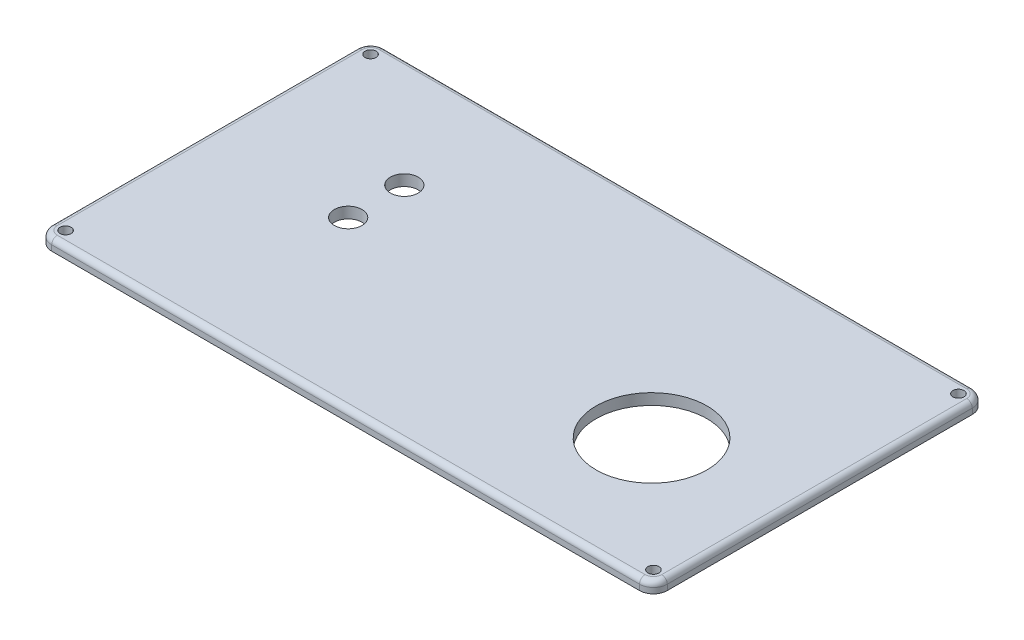
ISO-10303-21;
HEADER;
FILE_DESCRIPTION(('STEP AP214'),'2;1');
FILE_NAME('part.step','',(''),(''),'','','');
FILE_SCHEMA(('AUTOMOTIVE_DESIGN { 1 0 10303 214 1 1 1 1 }'));
ENDSEC;
DATA;
#1=APPLICATION_CONTEXT('core data for automotive mechanical design processes');
#2=APPLICATION_PROTOCOL_DEFINITION('international standard','automotive_design',2000,#1);
#3=PRODUCT_CONTEXT('',#1,'mechanical');
#4=PRODUCT('Part','Part','',(#3));
#5=PRODUCT_RELATED_PRODUCT_CATEGORY('part','',(#4));
#6=PRODUCT_DEFINITION_FORMATION('','',#4);
#7=PRODUCT_DEFINITION_CONTEXT('part definition',#1,'design');
#8=PRODUCT_DEFINITION('design','',#6,#7);
#9=PRODUCT_DEFINITION_SHAPE('','',#8);
#10=(LENGTH_UNIT() NAMED_UNIT(*) SI_UNIT(.MILLI.,.METRE.));
#11=(NAMED_UNIT(*) PLANE_ANGLE_UNIT() SI_UNIT($,.RADIAN.));
#12=(NAMED_UNIT(*) SI_UNIT($,.STERADIAN.) SOLID_ANGLE_UNIT());
#13=UNCERTAINTY_MEASURE_WITH_UNIT(LENGTH_MEASURE(1.E-05),#10,'distance_accuracy_value','');
#14=(GEOMETRIC_REPRESENTATION_CONTEXT(3) GLOBAL_UNCERTAINTY_ASSIGNED_CONTEXT((#13)) GLOBAL_UNIT_ASSIGNED_CONTEXT((#10,
#11,#12)) REPRESENTATION_CONTEXT('',''));
#15=CARTESIAN_POINT('',(0.,0.,0.));
#16=DIRECTION('',(0.,0.,1.));
#17=DIRECTION('',(1.,0.,0.));
#18=AXIS2_PLACEMENT_3D('',#15,#16,#17);
#19=CARTESIAN_POINT('',(0.,2.,0.));
#20=DIRECTION('',(1.,0.,0.));
#21=DIRECTION('',(0.,0.,-1.));
#22=AXIS2_PLACEMENT_3D('',#19,#20,#21);
#23=PLANE('',#22);
#24=DIRECTION('',(0.,-1.,0.));
#25=VECTOR('',#24,1.);
#26=CARTESIAN_POINT('',(0.,2.,-2.5));
#27=LINE('',#26,#25);
#28=CARTESIAN_POINT('',(0.,0.,-2.5));
#29=VERTEX_POINT('',#28);
#30=CARTESIAN_POINT('',(0.,1.,-2.5));
#31=VERTEX_POINT('',#30);
#32=EDGE_CURVE('E131',#29,#31,#27,.F.);
#33=ORIENTED_EDGE('',*,*,#32,.T.);
#34=DIRECTION('',(0.,0.,1.));
#35=VECTOR('',#34,1.);
#36=CARTESIAN_POINT('',(0.,1.,0.));
#37=LINE('',#36,#35);
#38=CARTESIAN_POINT('',(0.,1.,-57.5));
#39=VERTEX_POINT('',#38);
#40=EDGE_CURVE('E44',#31,#39,#37,.F.);
#41=ORIENTED_EDGE('',*,*,#40,.T.);
#42=DIRECTION('',(0.,-1.,0.));
#43=VECTOR('',#42,1.);
#44=CARTESIAN_POINT('',(0.,2.,-57.5));
#45=LINE('',#44,#43);
#46=CARTESIAN_POINT('',(0.,0.,-57.5));
#47=VERTEX_POINT('',#46);
#48=EDGE_CURVE('E124',#39,#47,#45,.T.);
#49=ORIENTED_EDGE('',*,*,#48,.T.);
#50=DIRECTION('',(0.,0.,1.));
#51=VECTOR('',#50,1.);
#52=CARTESIAN_POINT('',(0.,0.,0.));
#53=LINE('',#52,#51);
#54=EDGE_CURVE('E127',#47,#29,#53,.T.);
#55=ORIENTED_EDGE('',*,*,#54,.T.);
#56=EDGE_LOOP('',(#33,#41,#49,#55));
#57=FACE_BOUND('',#56,.T.);
#58=ADVANCED_FACE('F35',(#57),#23,.F.);
#59=CARTESIAN_POINT('',(0.,2.,0.));
#60=DIRECTION('',(0.,0.,-1.));
#61=DIRECTION('',(-1.,0.,0.));
#62=AXIS2_PLACEMENT_3D('',#59,#60,#61);
#63=PLANE('',#62);
#64=DIRECTION('',(0.,-1.,0.));
#65=VECTOR('',#64,1.);
#66=CARTESIAN_POINT('',(108.5,2.,0.));
#67=LINE('',#66,#65);
#68=CARTESIAN_POINT('',(108.5,0.,0.));
#69=VERTEX_POINT('',#68);
#70=CARTESIAN_POINT('',(108.5,1.,0.));
#71=VERTEX_POINT('',#70);
#72=EDGE_CURVE('E169',#69,#71,#67,.F.);
#73=ORIENTED_EDGE('',*,*,#72,.T.);
#74=DIRECTION('',(1.,0.,0.));
#75=VECTOR('',#74,1.);
#76=CARTESIAN_POINT('',(0.,1.,0.));
#77=LINE('',#76,#75);
#78=CARTESIAN_POINT('',(2.5,1.,0.));
#79=VERTEX_POINT('',#78);
#80=EDGE_CURVE('E205',#71,#79,#77,.F.);
#81=ORIENTED_EDGE('',*,*,#80,.T.);
#82=DIRECTION('',(0.,-1.,0.));
#83=VECTOR('',#82,1.);
#84=CARTESIAN_POINT('',(2.5,2.,0.));
#85=LINE('',#84,#83);
#86=CARTESIAN_POINT('',(2.5,0.,0.));
#87=VERTEX_POINT('',#86);
#88=EDGE_CURVE('E172',#79,#87,#85,.T.);
#89=ORIENTED_EDGE('',*,*,#88,.T.);
#90=DIRECTION('',(1.,0.,0.));
#91=VECTOR('',#90,1.);
#92=CARTESIAN_POINT('',(0.,0.,0.));
#93=LINE('',#92,#91);
#94=EDGE_CURVE('E147',#87,#69,#93,.T.);
#95=ORIENTED_EDGE('',*,*,#94,.T.);
#96=EDGE_LOOP('',(#73,#81,#89,#95));
#97=FACE_BOUND('',#96,.T.);
#98=ADVANCED_FACE('F297',(#97),#63,.F.);
#99=CARTESIAN_POINT('',(111.,2.,0.));
#100=DIRECTION('',(-1.,0.,0.));
#101=DIRECTION('',(0.,0.,1.));
#102=AXIS2_PLACEMENT_3D('',#99,#100,#101);
#103=PLANE('',#102);
#104=DIRECTION('',(0.,-1.,0.));
#105=VECTOR('',#104,1.);
#106=CARTESIAN_POINT('',(111.,2.,-57.5));
#107=LINE('',#106,#105);
#108=CARTESIAN_POINT('',(111.,0.,-57.5));
#109=VERTEX_POINT('',#108);
#110=CARTESIAN_POINT('',(111.,1.,-57.5));
#111=VERTEX_POINT('',#110);
#112=EDGE_CURVE('E176',#109,#111,#107,.F.);
#113=ORIENTED_EDGE('',*,*,#112,.T.);
#114=DIRECTION('',(0.,0.,-1.));
#115=VECTOR('',#114,1.);
#116=CARTESIAN_POINT('',(111.,1.,0.));
#117=LINE('',#116,#115);
#118=CARTESIAN_POINT('',(111.,1.,-2.5));
#119=VERTEX_POINT('',#118);
#120=EDGE_CURVE('E201',#111,#119,#117,.F.);
#121=ORIENTED_EDGE('',*,*,#120,.T.);
#122=DIRECTION('',(0.,-1.,0.));
#123=VECTOR('',#122,1.);
#124=CARTESIAN_POINT('',(111.,2.,-2.5));
#125=LINE('',#124,#123);
#126=CARTESIAN_POINT('',(111.,0.,-2.5));
#127=VERTEX_POINT('',#126);
#128=EDGE_CURVE('E174',#119,#127,#125,.T.);
#129=ORIENTED_EDGE('',*,*,#128,.T.);
#130=DIRECTION('',(0.,0.,-1.));
#131=VECTOR('',#130,1.);
#132=CARTESIAN_POINT('',(111.,0.,0.));
#133=LINE('',#132,#131);
#134=EDGE_CURVE('E151',#127,#109,#133,.T.);
#135=ORIENTED_EDGE('',*,*,#134,.T.);
#136=EDGE_LOOP('',(#113,#121,#129,#135));
#137=FACE_BOUND('',#136,.T.);
#138=ADVANCED_FACE('F291',(#137),#103,.F.);
#139=CARTESIAN_POINT('',(0.,2.,-60.));
#140=DIRECTION('',(0.,0.,1.));
#141=DIRECTION('',(1.,0.,0.));
#142=AXIS2_PLACEMENT_3D('',#139,#140,#141);
#143=PLANE('',#142);
#144=DIRECTION('',(0.,-1.,0.));
#145=VECTOR('',#144,1.);
#146=CARTESIAN_POINT('',(2.5,2.,-60.));
#147=LINE('',#146,#145);
#148=CARTESIAN_POINT('',(2.5,0.,-60.));
#149=VERTEX_POINT('',#148);
#150=CARTESIAN_POINT('',(2.5,1.,-60.));
#151=VERTEX_POINT('',#150);
#152=EDGE_CURVE('E137',#149,#151,#147,.F.);
#153=ORIENTED_EDGE('',*,*,#152,.T.);
#154=DIRECTION('',(-1.,0.,0.));
#155=VECTOR('',#154,1.);
#156=CARTESIAN_POINT('',(0.,1.,-60.));
#157=LINE('',#156,#155);
#158=CARTESIAN_POINT('',(108.5,1.,-60.));
#159=VERTEX_POINT('',#158);
#160=EDGE_CURVE('E196',#151,#159,#157,.F.);
#161=ORIENTED_EDGE('',*,*,#160,.T.);
#162=DIRECTION('',(0.,-1.,0.));
#163=VECTOR('',#162,1.);
#164=CARTESIAN_POINT('',(108.5,2.,-60.));
#165=LINE('',#164,#163);
#166=CARTESIAN_POINT('',(108.5,0.,-60.));
#167=VERTEX_POINT('',#166);
#168=EDGE_CURVE('E141',#159,#167,#165,.T.);
#169=ORIENTED_EDGE('',*,*,#168,.T.);
#170=DIRECTION('',(-1.,0.,0.));
#171=VECTOR('',#170,1.);
#172=CARTESIAN_POINT('',(0.,0.,-60.));
#173=LINE('',#172,#171);
#174=EDGE_CURVE('E160',#167,#149,#173,.T.);
#175=ORIENTED_EDGE('',*,*,#174,.T.);
#176=EDGE_LOOP('',(#153,#161,#169,#175));
#177=FACE_BOUND('',#176,.T.);
#178=ADVANCED_FACE('F281',(#177),#143,.F.);
#179=CARTESIAN_POINT('',(0.,2.,0.));
#180=DIRECTION('',(0.,-1.,0.));
#181=DIRECTION('',(0.,0.,-1.));
#182=AXIS2_PLACEMENT_3D('',#179,#180,#181);
#183=PLANE('',#182);
#184=CARTESIAN_POINT('',(108.5,2.,-57.5));
#185=DIRECTION('',(0.,-1.,0.));
#186=DIRECTION('',(0.,0.,-1.));
#187=AXIS2_PLACEMENT_3D('',#184,#185,#186);
#188=CIRCLE('',#187,1.5);
#189=CARTESIAN_POINT('',(110.,2.,-57.5));
#190=VERTEX_POINT('',#189);
#191=CARTESIAN_POINT('',(108.5,2.,-59.));
#192=VERTEX_POINT('',#191);
#193=EDGE_CURVE('E191',#190,#192,#188,.F.);
#194=ORIENTED_EDGE('',*,*,#193,.T.);
#195=DIRECTION('',(-1.,0.,0.));
#196=VECTOR('',#195,1.);
#197=CARTESIAN_POINT('',(0.,2.,-59.));
#198=LINE('',#197,#196);
#199=CARTESIAN_POINT('',(2.5,2.,-59.));
#200=VERTEX_POINT('',#199);
#201=EDGE_CURVE('E193',#192,#200,#198,.T.);
#202=ORIENTED_EDGE('',*,*,#201,.T.);
#203=CARTESIAN_POINT('',(2.5,2.,-57.5));
#204=DIRECTION('',(0.,-1.,0.));
#205=DIRECTION('',(0.,0.,-1.));
#206=AXIS2_PLACEMENT_3D('',#203,#204,#205);
#207=CIRCLE('',#206,1.5);
#208=CARTESIAN_POINT('',(1.,2.,-57.5));
#209=VERTEX_POINT('',#208);
#210=EDGE_CURVE('E179',#200,#209,#207,.F.);
#211=ORIENTED_EDGE('',*,*,#210,.T.);
#212=DIRECTION('',(0.,0.,1.));
#213=VECTOR('',#212,1.);
#214=CARTESIAN_POINT('',(1.,2.,0.));
#215=LINE('',#214,#213);
#216=CARTESIAN_POINT('',(1.,2.,-2.5));
#217=VERTEX_POINT('',#216);
#218=EDGE_CURVE('E181',#209,#217,#215,.T.);
#219=ORIENTED_EDGE('',*,*,#218,.T.);
#220=CARTESIAN_POINT('',(2.5,2.,-2.5));
#221=DIRECTION('',(0.,-1.,0.));
#222=DIRECTION('',(0.,0.,-1.));
#223=AXIS2_PLACEMENT_3D('',#220,#221,#222);
#224=CIRCLE('',#223,1.5);
#225=CARTESIAN_POINT('',(2.5,2.,-1.));
#226=VERTEX_POINT('',#225);
#227=EDGE_CURVE('E183',#217,#226,#224,.F.);
#228=ORIENTED_EDGE('',*,*,#227,.T.);
#229=DIRECTION('',(1.,0.,0.));
#230=VECTOR('',#229,1.);
#231=CARTESIAN_POINT('',(0.,2.,-1.));
#232=LINE('',#231,#230);
#233=CARTESIAN_POINT('',(108.5,2.,-1.));
#234=VERTEX_POINT('',#233);
#235=EDGE_CURVE('E185',#226,#234,#232,.T.);
#236=ORIENTED_EDGE('',*,*,#235,.T.);
#237=CARTESIAN_POINT('',(108.5,2.,-2.5));
#238=DIRECTION('',(0.,-1.,0.));
#239=DIRECTION('',(0.,0.,-1.));
#240=AXIS2_PLACEMENT_3D('',#237,#238,#239);
#241=CIRCLE('',#240,1.5);
#242=CARTESIAN_POINT('',(110.,2.,-2.5));
#243=VERTEX_POINT('',#242);
#244=EDGE_CURVE('E187',#234,#243,#241,.F.);
#245=ORIENTED_EDGE('',*,*,#244,.T.);
#246=DIRECTION('',(0.,0.,-1.));
#247=VECTOR('',#246,1.);
#248=CARTESIAN_POINT('',(110.,2.,0.));
#249=LINE('',#248,#247);
#250=EDGE_CURVE('E189',#243,#190,#249,.T.);
#251=ORIENTED_EDGE('',*,*,#250,.T.);
#252=EDGE_LOOP('',(#194,#202,#211,#219,#228,#236,#245,#251));
#253=FACE_BOUND('',#252,.T.);
#254=CARTESIAN_POINT('',(2.5,2.,-2.5));
#255=DIRECTION('',(0.,1.,0.));
#256=DIRECTION('',(0.,0.,1.));
#257=AXIS2_PLACEMENT_3D('',#254,#255,#256);
#258=CIRCLE('',#257,1.);
#259=CARTESIAN_POINT('',(2.5,2.,-1.5));
#260=VERTEX_POINT('',#259);
#261=EDGE_CURVE('E230',#260,#260,#258,.T.);
#262=ORIENTED_EDGE('',*,*,#261,.F.);
#263=EDGE_LOOP('',(#262));
#264=FACE_BOUND('',#263,.T.);
#265=CARTESIAN_POINT('',(108.5,2.,-2.5));
#266=DIRECTION('',(0.,1.,0.));
#267=DIRECTION('',(0.,0.,1.));
#268=AXIS2_PLACEMENT_3D('',#265,#266,#267);
#269=CIRCLE('',#268,0.999999999999998);
#270=CARTESIAN_POINT('',(108.5,2.,-1.5));
#271=VERTEX_POINT('',#270);
#272=EDGE_CURVE('E241',#271,#271,#269,.T.);
#273=ORIENTED_EDGE('',*,*,#272,.F.);
#274=EDGE_LOOP('',(#273));
#275=FACE_BOUND('',#274,.T.);
#276=CARTESIAN_POINT('',(108.5,2.,-57.5));
#277=DIRECTION('',(0.,1.,0.));
#278=DIRECTION('',(0.,0.,1.));
#279=AXIS2_PLACEMENT_3D('',#276,#277,#278);
#280=CIRCLE('',#279,0.999999999999998);
#281=CARTESIAN_POINT('',(108.5,2.,-56.5));
#282=VERTEX_POINT('',#281);
#283=EDGE_CURVE('E249',#282,#282,#280,.T.);
#284=ORIENTED_EDGE('',*,*,#283,.F.);
#285=EDGE_LOOP('',(#284));
#286=FACE_BOUND('',#285,.T.);
#287=CARTESIAN_POINT('',(2.5,2.,-57.5));
#288=DIRECTION('',(0.,1.,0.));
#289=DIRECTION('',(0.,0.,1.));
#290=AXIS2_PLACEMENT_3D('',#287,#288,#289);
#291=CIRCLE('',#290,1.);
#292=CARTESIAN_POINT('',(2.5,2.,-56.5));
#293=VERTEX_POINT('',#292);
#294=EDGE_CURVE('E255',#293,#293,#291,.T.);
#295=ORIENTED_EDGE('',*,*,#294,.F.);
#296=EDGE_LOOP('',(#295));
#297=FACE_BOUND('',#296,.T.);
#298=CARTESIAN_POINT('',(87.7359334352328,2.,-22.9284518842758));
#299=DIRECTION('',(0.,1.,0.));
#300=DIRECTION('',(0.,0.,1.));
#301=AXIS2_PLACEMENT_3D('',#298,#299,#300);
#302=CIRCLE('',#301,9.99999999999999);
#303=CARTESIAN_POINT('',(87.7359334352328,2.,-12.9284518842758));
#304=VERTEX_POINT('',#303);
#305=EDGE_CURVE('E261',#304,#304,#302,.T.);
#306=ORIENTED_EDGE('',*,*,#305,.F.);
#307=EDGE_LOOP('',(#306));
#308=FACE_BOUND('',#307,.T.);
#309=CARTESIAN_POINT('',(25.9625,2.,-40.1181984873243));
#310=DIRECTION('',(0.,1.,0.));
#311=DIRECTION('',(0.,0.,1.));
#312=AXIS2_PLACEMENT_3D('',#309,#310,#311);
#313=CIRCLE('',#312,2.5);
#314=CARTESIAN_POINT('',(25.9625,2.,-37.6181984873243));
#315=VERTEX_POINT('',#314);
#316=EDGE_CURVE('E267',#315,#315,#313,.T.);
#317=ORIENTED_EDGE('',*,*,#316,.F.);
#318=EDGE_LOOP('',(#317));
#319=FACE_BOUND('',#318,.T.);
#320=CARTESIAN_POINT('',(25.9625,2.,-30.));
#321=DIRECTION('',(0.,1.,0.));
#322=DIRECTION('',(0.,0.,1.));
#323=AXIS2_PLACEMENT_3D('',#320,#321,#322);
#324=CIRCLE('',#323,2.5);
#325=CARTESIAN_POINT('',(25.9625,2.,-27.5));
#326=VERTEX_POINT('',#325);
#327=EDGE_CURVE('E154',#326,#326,#324,.T.);
#328=ORIENTED_EDGE('',*,*,#327,.F.);
#329=EDGE_LOOP('',(#328));
#330=FACE_BOUND('',#329,.T.);
#331=ADVANCED_FACE('F279',(#253,#264,#275,#286,#297,#308,#319,#330),#183,.F.);
#332=CARTESIAN_POINT('',(0.,0.,0.));
#333=DIRECTION('',(0.,-1.,0.));
#334=DIRECTION('',(0.,0.,-1.));
#335=AXIS2_PLACEMENT_3D('',#332,#333,#334);
#336=PLANE('',#335);
#337=CARTESIAN_POINT('',(2.5,0.,-2.5));
#338=DIRECTION('',(0.,1.,0.));
#339=DIRECTION('',(0.,0.,1.));
#340=AXIS2_PLACEMENT_3D('',#337,#338,#339);
#341=CIRCLE('',#340,1.);
#342=CARTESIAN_POINT('',(2.5,0.,-1.5));
#343=VERTEX_POINT('',#342);
#344=EDGE_CURVE('E236',#343,#343,#341,.T.);
#345=ORIENTED_EDGE('',*,*,#344,.T.);
#346=EDGE_LOOP('',(#345));
#347=FACE_BOUND('',#346,.T.);
#348=CARTESIAN_POINT('',(108.5,0.,-2.5));
#349=DIRECTION('',(0.,1.,0.));
#350=DIRECTION('',(0.,0.,1.));
#351=AXIS2_PLACEMENT_3D('',#348,#349,#350);
#352=CIRCLE('',#351,0.999999999999998);
#353=CARTESIAN_POINT('',(108.5,0.,-1.5));
#354=VERTEX_POINT('',#353);
#355=EDGE_CURVE('E246',#354,#354,#352,.T.);
#356=ORIENTED_EDGE('',*,*,#355,.T.);
#357=EDGE_LOOP('',(#356));
#358=FACE_BOUND('',#357,.T.);
#359=CARTESIAN_POINT('',(108.5,0.,-57.5));
#360=DIRECTION('',(0.,1.,0.));
#361=DIRECTION('',(0.,0.,1.));
#362=AXIS2_PLACEMENT_3D('',#359,#360,#361);
#363=CIRCLE('',#362,0.999999999999998);
#364=CARTESIAN_POINT('',(108.5,0.,-56.5));
#365=VERTEX_POINT('',#364);
#366=EDGE_CURVE('E252',#365,#365,#363,.T.);
#367=ORIENTED_EDGE('',*,*,#366,.T.);
#368=EDGE_LOOP('',(#367));
#369=FACE_BOUND('',#368,.T.);
#370=CARTESIAN_POINT('',(2.5,0.,-57.5));
#371=DIRECTION('',(0.,1.,0.));
#372=DIRECTION('',(0.,0.,1.));
#373=AXIS2_PLACEMENT_3D('',#370,#371,#372);
#374=CIRCLE('',#373,1.);
#375=CARTESIAN_POINT('',(2.5,0.,-56.5));
#376=VERTEX_POINT('',#375);
#377=EDGE_CURVE('E258',#376,#376,#374,.T.);
#378=ORIENTED_EDGE('',*,*,#377,.T.);
#379=EDGE_LOOP('',(#378));
#380=FACE_BOUND('',#379,.T.);
#381=CARTESIAN_POINT('',(87.7359334352328,0.,-22.9284518842758));
#382=DIRECTION('',(0.,1.,0.));
#383=DIRECTION('',(0.,0.,1.));
#384=AXIS2_PLACEMENT_3D('',#381,#382,#383);
#385=CIRCLE('',#384,9.99999999999999);
#386=CARTESIAN_POINT('',(87.7359334352328,0.,-12.9284518842758));
#387=VERTEX_POINT('',#386);
#388=EDGE_CURVE('E264',#387,#387,#385,.T.);
#389=ORIENTED_EDGE('',*,*,#388,.T.);
#390=EDGE_LOOP('',(#389));
#391=FACE_BOUND('',#390,.T.);
#392=CARTESIAN_POINT('',(25.9625,0.,-40.1181984873243));
#393=DIRECTION('',(0.,1.,0.));
#394=DIRECTION('',(0.,0.,1.));
#395=AXIS2_PLACEMENT_3D('',#392,#393,#394);
#396=CIRCLE('',#395,2.5);
#397=CARTESIAN_POINT('',(25.9625,0.,-37.6181984873243));
#398=VERTEX_POINT('',#397);
#399=EDGE_CURVE('E270',#398,#398,#396,.T.);
#400=ORIENTED_EDGE('',*,*,#399,.T.);
#401=EDGE_LOOP('',(#400));
#402=FACE_BOUND('',#401,.T.);
#403=CARTESIAN_POINT('',(25.9625,0.,-30.));
#404=DIRECTION('',(0.,1.,0.));
#405=DIRECTION('',(0.,0.,1.));
#406=AXIS2_PLACEMENT_3D('',#403,#404,#405);
#407=CIRCLE('',#406,2.5);
#408=CARTESIAN_POINT('',(25.9625,0.,-27.5));
#409=VERTEX_POINT('',#408);
#410=EDGE_CURVE('E148',#409,#409,#407,.T.);
#411=ORIENTED_EDGE('',*,*,#410,.T.);
#412=EDGE_LOOP('',(#411));
#413=FACE_BOUND('',#412,.T.);
#414=ORIENTED_EDGE('',*,*,#54,.F.);
#415=CARTESIAN_POINT('',(2.5,0.,-57.5));
#416=DIRECTION('',(0.,-1.,0.));
#417=DIRECTION('',(0.,0.,-1.));
#418=AXIS2_PLACEMENT_3D('',#415,#416,#417);
#419=CIRCLE('',#418,2.5);
#420=EDGE_CURVE('E134',#47,#149,#419,.T.);
#421=ORIENTED_EDGE('',*,*,#420,.T.);
#422=ORIENTED_EDGE('',*,*,#174,.F.);
#423=CARTESIAN_POINT('',(108.5,0.,-57.5));
#424=DIRECTION('',(0.,-1.,0.));
#425=DIRECTION('',(0.,0.,-1.));
#426=AXIS2_PLACEMENT_3D('',#423,#424,#425);
#427=CIRCLE('',#426,2.5);
#428=EDGE_CURVE('E164',#167,#109,#427,.T.);
#429=ORIENTED_EDGE('',*,*,#428,.T.);
#430=ORIENTED_EDGE('',*,*,#134,.F.);
#431=CARTESIAN_POINT('',(108.5,0.,-2.5));
#432=DIRECTION('',(0.,-1.,0.));
#433=DIRECTION('',(0.,0.,-1.));
#434=AXIS2_PLACEMENT_3D('',#431,#432,#433);
#435=CIRCLE('',#434,2.5);
#436=EDGE_CURVE('E130',#127,#69,#435,.T.);
#437=ORIENTED_EDGE('',*,*,#436,.T.);
#438=ORIENTED_EDGE('',*,*,#94,.F.);
#439=CARTESIAN_POINT('',(2.5,0.,-2.5));
#440=DIRECTION('',(0.,-1.,0.));
#441=DIRECTION('',(0.,0.,-1.));
#442=AXIS2_PLACEMENT_3D('',#439,#440,#441);
#443=CIRCLE('',#442,2.5);
#444=EDGE_CURVE('E142',#87,#29,#443,.T.);
#445=ORIENTED_EDGE('',*,*,#444,.T.);
#446=EDGE_LOOP('',(#414,#421,#422,#429,#430,#437,#438,#445));
#447=FACE_BOUND('',#446,.T.);
#448=ADVANCED_FACE('F144',(#347,#358,#369,#380,#391,#402,#413,#447),#336,.T.);
#449=CARTESIAN_POINT('',(25.9625,0.,-30.));
#450=DIRECTION('',(0.,1.,0.));
#451=DIRECTION('',(0.,0.,1.));
#452=AXIS2_PLACEMENT_3D('',#449,#450,#451);
#453=CYLINDRICAL_SURFACE('',#452,2.5);
#454=ORIENTED_EDGE('',*,*,#410,.F.);
#455=EDGE_LOOP('',(#454));
#456=FACE_BOUND('',#455,.T.);
#457=ORIENTED_EDGE('',*,*,#327,.T.);
#458=EDGE_LOOP('',(#457));
#459=FACE_BOUND('',#458,.T.);
#460=ADVANCED_FACE('F277',(#456,#459),#453,.F.);
#461=CARTESIAN_POINT('',(25.9625,0.,-40.1181984873243));
#462=DIRECTION('',(0.,1.,0.));
#463=DIRECTION('',(0.,0.,1.));
#464=AXIS2_PLACEMENT_3D('',#461,#462,#463);
#465=CYLINDRICAL_SURFACE('',#464,2.5);
#466=ORIENTED_EDGE('',*,*,#399,.F.);
#467=EDGE_LOOP('',(#466));
#468=FACE_BOUND('',#467,.T.);
#469=ORIENTED_EDGE('',*,*,#316,.T.);
#470=EDGE_LOOP('',(#469));
#471=FACE_BOUND('',#470,.T.);
#472=ADVANCED_FACE('F403',(#468,#471),#465,.F.);
#473=CARTESIAN_POINT('',(87.7359334352328,0.,-22.9284518842758));
#474=DIRECTION('',(0.,1.,0.));
#475=DIRECTION('',(0.,0.,1.));
#476=AXIS2_PLACEMENT_3D('',#473,#474,#475);
#477=CYLINDRICAL_SURFACE('',#476,9.99999999999999);
#478=ORIENTED_EDGE('',*,*,#388,.F.);
#479=EDGE_LOOP('',(#478));
#480=FACE_BOUND('',#479,.T.);
#481=ORIENTED_EDGE('',*,*,#305,.T.);
#482=EDGE_LOOP('',(#481));
#483=FACE_BOUND('',#482,.T.);
#484=ADVANCED_FACE('F409',(#480,#483),#477,.F.);
#485=CARTESIAN_POINT('',(2.5,0.,-57.5));
#486=DIRECTION('',(0.,1.,0.));
#487=DIRECTION('',(0.,0.,1.));
#488=AXIS2_PLACEMENT_3D('',#485,#486,#487);
#489=CYLINDRICAL_SURFACE('',#488,1.);
#490=ORIENTED_EDGE('',*,*,#377,.F.);
#491=EDGE_LOOP('',(#490));
#492=FACE_BOUND('',#491,.T.);
#493=ORIENTED_EDGE('',*,*,#294,.T.);
#494=EDGE_LOOP('',(#493));
#495=FACE_BOUND('',#494,.T.);
#496=ADVANCED_FACE('F417',(#492,#495),#489,.F.);
#497=CARTESIAN_POINT('',(108.5,0.,-57.5));
#498=DIRECTION('',(0.,1.,0.));
#499=DIRECTION('',(0.,0.,1.));
#500=AXIS2_PLACEMENT_3D('',#497,#498,#499);
#501=CYLINDRICAL_SURFACE('',#500,0.999999999999998);
#502=ORIENTED_EDGE('',*,*,#366,.F.);
#503=EDGE_LOOP('',(#502));
#504=FACE_BOUND('',#503,.T.);
#505=ORIENTED_EDGE('',*,*,#283,.T.);
#506=EDGE_LOOP('',(#505));
#507=FACE_BOUND('',#506,.T.);
#508=ADVANCED_FACE('F425',(#504,#507),#501,.F.);
#509=CARTESIAN_POINT('',(108.5,0.,-2.5));
#510=DIRECTION('',(0.,1.,0.));
#511=DIRECTION('',(0.,0.,1.));
#512=AXIS2_PLACEMENT_3D('',#509,#510,#511);
#513=CYLINDRICAL_SURFACE('',#512,0.999999999999998);
#514=ORIENTED_EDGE('',*,*,#355,.F.);
#515=EDGE_LOOP('',(#514));
#516=FACE_BOUND('',#515,.T.);
#517=ORIENTED_EDGE('',*,*,#272,.T.);
#518=EDGE_LOOP('',(#517));
#519=FACE_BOUND('',#518,.T.);
#520=ADVANCED_FACE('F433',(#516,#519),#513,.F.);
#521=CARTESIAN_POINT('',(2.5,0.,-2.5));
#522=DIRECTION('',(0.,1.,0.));
#523=DIRECTION('',(0.,0.,1.));
#524=AXIS2_PLACEMENT_3D('',#521,#522,#523);
#525=CYLINDRICAL_SURFACE('',#524,1.);
#526=ORIENTED_EDGE('',*,*,#344,.F.);
#527=EDGE_LOOP('',(#526));
#528=FACE_BOUND('',#527,.T.);
#529=ORIENTED_EDGE('',*,*,#261,.T.);
#530=EDGE_LOOP('',(#529));
#531=FACE_BOUND('',#530,.T.);
#532=ADVANCED_FACE('F309',(#528,#531),#525,.F.);
#533=CARTESIAN_POINT('',(2.5,2.,-57.5));
#534=DIRECTION('',(0.,-1.,0.));
#535=DIRECTION('',(0.,0.,-1.));
#536=AXIS2_PLACEMENT_3D('',#533,#534,#535);
#537=CYLINDRICAL_SURFACE('',#536,2.5);
#538=ORIENTED_EDGE('',*,*,#48,.F.);
#539=CARTESIAN_POINT('',(2.5,1.,-57.5));
#540=DIRECTION('',(0.,-1.,0.));
#541=DIRECTION('',(0.,0.,-1.));
#542=AXIS2_PLACEMENT_3D('',#539,#540,#541);
#543=CIRCLE('',#542,2.5);
#544=EDGE_CURVE('E11',#39,#151,#543,.T.);
#545=ORIENTED_EDGE('',*,*,#544,.T.);
#546=ORIENTED_EDGE('',*,*,#152,.F.);
#547=ORIENTED_EDGE('',*,*,#420,.F.);
#548=EDGE_LOOP('',(#538,#545,#546,#547));
#549=FACE_BOUND('',#548,.T.);
#550=ADVANCED_FACE('F135',(#549),#537,.T.);
#551=CARTESIAN_POINT('',(2.5,2.,-2.5));
#552=DIRECTION('',(0.,-1.,0.));
#553=DIRECTION('',(0.,0.,-1.));
#554=AXIS2_PLACEMENT_3D('',#551,#552,#553);
#555=CYLINDRICAL_SURFACE('',#554,2.5);
#556=ORIENTED_EDGE('',*,*,#88,.F.);
#557=CARTESIAN_POINT('',(2.5,1.,-2.5));
#558=DIRECTION('',(0.,-1.,0.));
#559=DIRECTION('',(0.,0.,-1.));
#560=AXIS2_PLACEMENT_3D('',#557,#558,#559);
#561=CIRCLE('',#560,2.5);
#562=EDGE_CURVE('E59',#79,#31,#561,.T.);
#563=ORIENTED_EDGE('',*,*,#562,.T.);
#564=ORIENTED_EDGE('',*,*,#32,.F.);
#565=ORIENTED_EDGE('',*,*,#444,.F.);
#566=EDGE_LOOP('',(#556,#563,#564,#565));
#567=FACE_BOUND('',#566,.T.);
#568=ADVANCED_FACE('F308',(#567),#555,.T.);
#569=CARTESIAN_POINT('',(108.5,2.,-57.5));
#570=DIRECTION('',(0.,-1.,0.));
#571=DIRECTION('',(0.,0.,-1.));
#572=AXIS2_PLACEMENT_3D('',#569,#570,#571);
#573=CYLINDRICAL_SURFACE('',#572,2.5);
#574=ORIENTED_EDGE('',*,*,#168,.F.);
#575=CARTESIAN_POINT('',(108.5,1.,-57.5));
#576=DIRECTION('',(0.,-1.,0.));
#577=DIRECTION('',(0.,0.,-1.));
#578=AXIS2_PLACEMENT_3D('',#575,#576,#577);
#579=CIRCLE('',#578,2.5);
#580=EDGE_CURVE('E199',#159,#111,#579,.T.);
#581=ORIENTED_EDGE('',*,*,#580,.T.);
#582=ORIENTED_EDGE('',*,*,#112,.F.);
#583=ORIENTED_EDGE('',*,*,#428,.F.);
#584=EDGE_LOOP('',(#574,#581,#582,#583));
#585=FACE_BOUND('',#584,.T.);
#586=ADVANCED_FACE('F312',(#585),#573,.T.);
#587=CARTESIAN_POINT('',(108.5,2.,-2.5));
#588=DIRECTION('',(0.,-1.,0.));
#589=DIRECTION('',(0.,0.,-1.));
#590=AXIS2_PLACEMENT_3D('',#587,#588,#589);
#591=CYLINDRICAL_SURFACE('',#590,2.5);
#592=ORIENTED_EDGE('',*,*,#128,.F.);
#593=CARTESIAN_POINT('',(108.5,1.,-2.5));
#594=DIRECTION('',(0.,-1.,0.));
#595=DIRECTION('',(0.,0.,-1.));
#596=AXIS2_PLACEMENT_3D('',#593,#594,#595);
#597=CIRCLE('',#596,2.5);
#598=EDGE_CURVE('E203',#119,#71,#597,.T.);
#599=ORIENTED_EDGE('',*,*,#598,.T.);
#600=ORIENTED_EDGE('',*,*,#72,.F.);
#601=ORIENTED_EDGE('',*,*,#436,.F.);
#602=EDGE_LOOP('',(#592,#599,#600,#601));
#603=FACE_BOUND('',#602,.T.);
#604=ADVANCED_FACE('F315',(#603),#591,.T.);
#605=CARTESIAN_POINT('',(0.,1.,-1.));
#606=DIRECTION('',(1.,0.,0.));
#607=DIRECTION('',(0.,0.,-1.));
#608=AXIS2_PLACEMENT_3D('',#605,#606,#607);
#609=CYLINDRICAL_SURFACE('',#608,1.);
#610=CARTESIAN_POINT('',(2.5,1.,-1.));
#611=DIRECTION('',(-1.,0.,0.));
#612=DIRECTION('',(0.,0.,1.));
#613=AXIS2_PLACEMENT_3D('',#610,#611,#612);
#614=CIRCLE('',#613,1.);
#615=EDGE_CURVE('E224',#79,#226,#614,.T.);
#616=ORIENTED_EDGE('',*,*,#615,.F.);
#617=ORIENTED_EDGE('',*,*,#80,.F.);
#618=CARTESIAN_POINT('',(108.5,1.,-1.));
#619=DIRECTION('',(1.,0.,0.));
#620=DIRECTION('',(0.,0.,-1.));
#621=AXIS2_PLACEMENT_3D('',#618,#619,#620);
#622=CIRCLE('',#621,1.);
#623=EDGE_CURVE('E39',#234,#71,#622,.T.);
#624=ORIENTED_EDGE('',*,*,#623,.F.);
#625=ORIENTED_EDGE('',*,*,#235,.F.);
#626=EDGE_LOOP('',(#616,#617,#624,#625));
#627=FACE_BOUND('',#626,.T.);
#628=ADVANCED_FACE('F37',(#627),#609,.T.);
#629=CARTESIAN_POINT('',(108.5,1.,-2.5));
#630=DIRECTION('',(0.,-1.,0.));
#631=DIRECTION('',(0.,0.,-1.));
#632=AXIS2_PLACEMENT_3D('',#629,#630,#631);
#633=TOROIDAL_SURFACE('',#632,1.5,1.);
#634=ORIENTED_EDGE('',*,*,#623,.T.);
#635=ORIENTED_EDGE('',*,*,#598,.F.);
#636=CARTESIAN_POINT('',(110.,1.,-2.5));
#637=DIRECTION('',(0.,0.,-1.));
#638=DIRECTION('',(-1.,0.,0.));
#639=AXIS2_PLACEMENT_3D('',#636,#637,#638);
#640=CIRCLE('',#639,1.);
#641=EDGE_CURVE('E222',#243,#119,#640,.T.);
#642=ORIENTED_EDGE('',*,*,#641,.F.);
#643=ORIENTED_EDGE('',*,*,#244,.F.);
#644=EDGE_LOOP('',(#634,#635,#642,#643));
#645=FACE_BOUND('',#644,.T.);
#646=ADVANCED_FACE('F342',(#645),#633,.T.);
#647=CARTESIAN_POINT('',(2.5,1.,-2.5));
#648=DIRECTION('',(0.,-1.,0.));
#649=DIRECTION('',(0.,0.,-1.));
#650=AXIS2_PLACEMENT_3D('',#647,#648,#649);
#651=TOROIDAL_SURFACE('',#650,1.5,1.);
#652=ORIENTED_EDGE('',*,*,#615,.T.);
#653=ORIENTED_EDGE('',*,*,#227,.F.);
#654=CARTESIAN_POINT('',(1.,1.,-2.5));
#655=DIRECTION('',(0.,0.,-1.));
#656=DIRECTION('',(-1.,0.,0.));
#657=AXIS2_PLACEMENT_3D('',#654,#655,#656);
#658=CIRCLE('',#657,1.);
#659=EDGE_CURVE('E219',#31,#217,#658,.T.);
#660=ORIENTED_EDGE('',*,*,#659,.F.);
#661=ORIENTED_EDGE('',*,*,#562,.F.);
#662=EDGE_LOOP('',(#652,#653,#660,#661));
#663=FACE_BOUND('',#662,.T.);
#664=ADVANCED_FACE('F339',(#663),#651,.T.);
#665=CARTESIAN_POINT('',(110.,1.,0.));
#666=DIRECTION('',(0.,0.,-1.));
#667=DIRECTION('',(-1.,0.,0.));
#668=AXIS2_PLACEMENT_3D('',#665,#666,#667);
#669=CYLINDRICAL_SURFACE('',#668,1.);
#670=ORIENTED_EDGE('',*,*,#641,.T.);
#671=ORIENTED_EDGE('',*,*,#120,.F.);
#672=CARTESIAN_POINT('',(110.,1.,-57.5));
#673=DIRECTION('',(0.,0.,-1.));
#674=DIRECTION('',(-1.,0.,0.));
#675=AXIS2_PLACEMENT_3D('',#672,#673,#674);
#676=CIRCLE('',#675,1.);
#677=EDGE_CURVE('E216',#190,#111,#676,.T.);
#678=ORIENTED_EDGE('',*,*,#677,.F.);
#679=ORIENTED_EDGE('',*,*,#250,.F.);
#680=EDGE_LOOP('',(#670,#671,#678,#679));
#681=FACE_BOUND('',#680,.T.);
#682=ADVANCED_FACE('F335',(#681),#669,.T.);
#683=CARTESIAN_POINT('',(1.,1.,0.));
#684=DIRECTION('',(0.,0.,1.));
#685=DIRECTION('',(1.,0.,0.));
#686=AXIS2_PLACEMENT_3D('',#683,#684,#685);
#687=CYLINDRICAL_SURFACE('',#686,1.);
#688=ORIENTED_EDGE('',*,*,#659,.T.);
#689=ORIENTED_EDGE('',*,*,#218,.F.);
#690=CARTESIAN_POINT('',(1.,1.,-57.5));
#691=DIRECTION('',(0.,0.,-1.));
#692=DIRECTION('',(-1.,0.,0.));
#693=AXIS2_PLACEMENT_3D('',#690,#691,#692);
#694=CIRCLE('',#693,1.);
#695=EDGE_CURVE('E213',#39,#209,#694,.T.);
#696=ORIENTED_EDGE('',*,*,#695,.F.);
#697=ORIENTED_EDGE('',*,*,#40,.F.);
#698=EDGE_LOOP('',(#688,#689,#696,#697));
#699=FACE_BOUND('',#698,.T.);
#700=ADVANCED_FACE('F331',(#699),#687,.T.);
#701=CARTESIAN_POINT('',(108.5,1.,-57.5));
#702=DIRECTION('',(0.,-1.,0.));
#703=DIRECTION('',(0.,0.,-1.));
#704=AXIS2_PLACEMENT_3D('',#701,#702,#703);
#705=TOROIDAL_SURFACE('',#704,1.5,1.);
#706=ORIENTED_EDGE('',*,*,#677,.T.);
#707=ORIENTED_EDGE('',*,*,#580,.F.);
#708=CARTESIAN_POINT('',(108.5,1.,-59.));
#709=DIRECTION('',(-1.,0.,0.));
#710=DIRECTION('',(0.,0.,1.));
#711=AXIS2_PLACEMENT_3D('',#708,#709,#710);
#712=CIRCLE('',#711,1.);
#713=EDGE_CURVE('E211',#192,#159,#712,.T.);
#714=ORIENTED_EDGE('',*,*,#713,.F.);
#715=ORIENTED_EDGE('',*,*,#193,.F.);
#716=EDGE_LOOP('',(#706,#707,#714,#715));
#717=FACE_BOUND('',#716,.T.);
#718=ADVANCED_FACE('F327',(#717),#705,.T.);
#719=CARTESIAN_POINT('',(2.5,1.,-57.5));
#720=DIRECTION('',(0.,-1.,0.));
#721=DIRECTION('',(0.,0.,-1.));
#722=AXIS2_PLACEMENT_3D('',#719,#720,#721);
#723=TOROIDAL_SURFACE('',#722,1.5,1.);
#724=ORIENTED_EDGE('',*,*,#695,.T.);
#725=ORIENTED_EDGE('',*,*,#210,.F.);
#726=CARTESIAN_POINT('',(2.5,1.,-59.));
#727=DIRECTION('',(1.,0.,0.));
#728=DIRECTION('',(0.,0.,-1.));
#729=AXIS2_PLACEMENT_3D('',#726,#727,#728);
#730=CIRCLE('',#729,1.);
#731=EDGE_CURVE('E209',#151,#200,#730,.T.);
#732=ORIENTED_EDGE('',*,*,#731,.F.);
#733=ORIENTED_EDGE('',*,*,#544,.F.);
#734=EDGE_LOOP('',(#724,#725,#732,#733));
#735=FACE_BOUND('',#734,.T.);
#736=ADVANCED_FACE('F323',(#735),#723,.T.);
#737=CARTESIAN_POINT('',(0.,1.,-59.));
#738=DIRECTION('',(-1.,0.,0.));
#739=DIRECTION('',(0.,0.,1.));
#740=AXIS2_PLACEMENT_3D('',#737,#738,#739);
#741=CYLINDRICAL_SURFACE('',#740,1.);
#742=ORIENTED_EDGE('',*,*,#713,.T.);
#743=ORIENTED_EDGE('',*,*,#160,.F.);
#744=ORIENTED_EDGE('',*,*,#731,.T.);
#745=ORIENTED_EDGE('',*,*,#201,.F.);
#746=EDGE_LOOP('',(#742,#743,#744,#745));
#747=FACE_BOUND('',#746,.T.);
#748=ADVANCED_FACE('F320',(#747),#741,.T.);
#749=CLOSED_SHELL('',(#58,#98,#138,#178,#331,#448,#460,#472,#484,#496,#508,#520,#532,#550,#568,
#586,#604,#628,#646,#664,#682,#700,#718,#736,#748));
#750=MANIFOLD_SOLID_BREP('B2',#749);
#751=ADVANCED_BREP_SHAPE_REPRESENTATION('',(#18,#750),#14);
#752=SHAPE_DEFINITION_REPRESENTATION(#9,#751);
ENDSEC;
END-ISO-10303-21;
